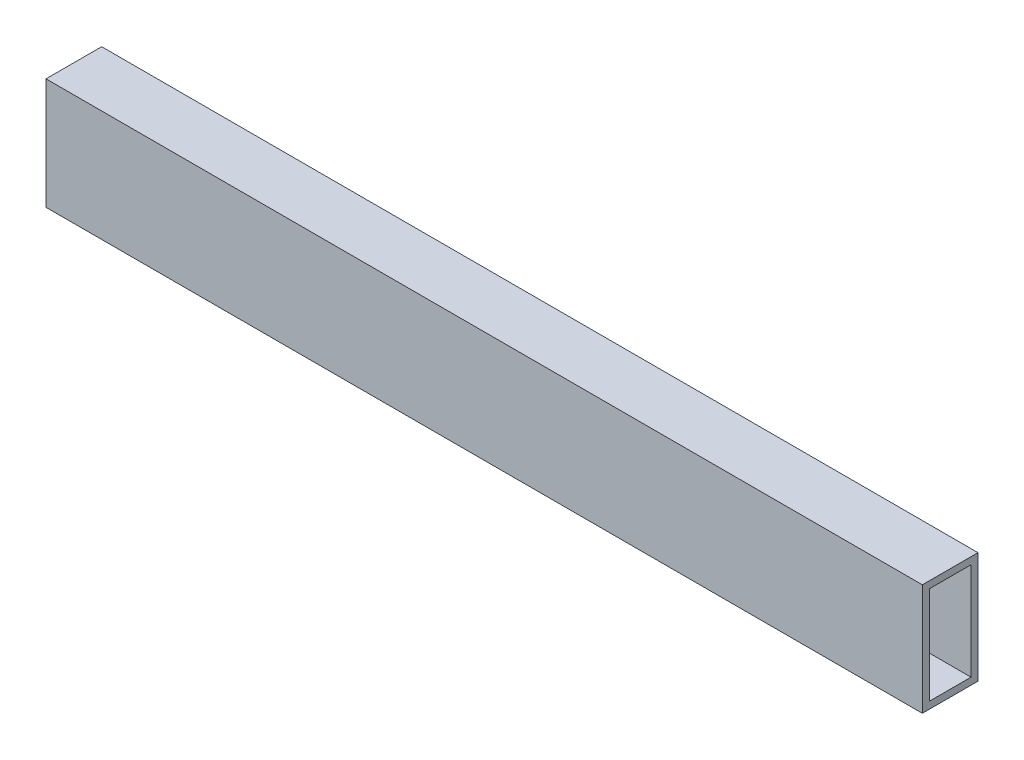
ISO-10303-21;
HEADER;
FILE_DESCRIPTION(('STEP AP214'),'2;1');
FILE_NAME('part.step','',(''),(''),'','','');
FILE_SCHEMA(('AUTOMOTIVE_DESIGN { 1 0 10303 214 1 1 1 1 }'));
ENDSEC;
DATA;
#1=APPLICATION_CONTEXT('core data for automotive mechanical design processes');
#2=APPLICATION_PROTOCOL_DEFINITION('international standard','automotive_design',2000,#1);
#3=PRODUCT_CONTEXT('',#1,'mechanical');
#4=PRODUCT('Part','Part','',(#3));
#5=PRODUCT_RELATED_PRODUCT_CATEGORY('part','',(#4));
#6=PRODUCT_DEFINITION_FORMATION('','',#4);
#7=PRODUCT_DEFINITION_CONTEXT('part definition',#1,'design');
#8=PRODUCT_DEFINITION('design','',#6,#7);
#9=PRODUCT_DEFINITION_SHAPE('','',#8);
#10=(LENGTH_UNIT() NAMED_UNIT(*) SI_UNIT(.MILLI.,.METRE.));
#11=(NAMED_UNIT(*) PLANE_ANGLE_UNIT() SI_UNIT($,.RADIAN.));
#12=(NAMED_UNIT(*) SI_UNIT($,.STERADIAN.) SOLID_ANGLE_UNIT());
#13=UNCERTAINTY_MEASURE_WITH_UNIT(LENGTH_MEASURE(1.E-05),#10,'distance_accuracy_value','');
#14=(GEOMETRIC_REPRESENTATION_CONTEXT(3) GLOBAL_UNCERTAINTY_ASSIGNED_CONTEXT((#13)) GLOBAL_UNIT_ASSIGNED_CONTEXT((#10,
#11,#12)) REPRESENTATION_CONTEXT('',''));
#15=CARTESIAN_POINT('',(0.,0.,0.));
#16=DIRECTION('',(0.,0.,1.));
#17=DIRECTION('',(1.,0.,0.));
#18=AXIS2_PLACEMENT_3D('',#15,#16,#17);
#19=CARTESIAN_POINT('',(400.,0.,0.));
#20=DIRECTION('',(-1.,0.,0.));
#21=DIRECTION('',(0.,0.,1.));
#22=AXIS2_PLACEMENT_3D('',#19,#20,#21);
#23=PLANE('',#22);
#24=DIRECTION('',(0.,-1.,0.));
#25=VECTOR('',#24,1.);
#26=CARTESIAN_POINT('',(400.,0.,0.));
#27=LINE('',#26,#25);
#28=CARTESIAN_POINT('',(400.,50.8,0.));
#29=VERTEX_POINT('',#28);
#30=CARTESIAN_POINT('',(400.,0.,0.));
#31=VERTEX_POINT('',#30);
#32=EDGE_CURVE('E134',#29,#31,#27,.T.);
#33=ORIENTED_EDGE('',*,*,#32,.T.);
#34=DIRECTION('',(0.,0.,-1.));
#35=VECTOR('',#34,1.);
#36=CARTESIAN_POINT('',(400.,0.,0.));
#37=LINE('',#36,#35);
#38=CARTESIAN_POINT('',(400.,0.,-25.4));
#39=VERTEX_POINT('',#38);
#40=EDGE_CURVE('E137',#31,#39,#37,.T.);
#41=ORIENTED_EDGE('',*,*,#40,.T.);
#42=DIRECTION('',(0.,1.,0.));
#43=VECTOR('',#42,1.);
#44=CARTESIAN_POINT('',(400.,0.,-25.4));
#45=LINE('',#44,#43);
#46=CARTESIAN_POINT('',(400.,50.8,-25.4));
#47=VERTEX_POINT('',#46);
#48=EDGE_CURVE('E140',#39,#47,#45,.T.);
#49=ORIENTED_EDGE('',*,*,#48,.T.);
#50=DIRECTION('',(0.,0.,1.));
#51=VECTOR('',#50,1.);
#52=CARTESIAN_POINT('',(400.,50.8,0.));
#53=LINE('',#52,#51);
#54=EDGE_CURVE('E142',#47,#29,#53,.T.);
#55=ORIENTED_EDGE('',*,*,#54,.T.);
#56=EDGE_LOOP('',(#33,#41,#49,#55));
#57=FACE_BOUND('',#56,.T.);
#58=DIRECTION('',(0.,-1.,0.));
#59=VECTOR('',#58,1.);
#60=CARTESIAN_POINT('',(400.,47.625,-3.175));
#61=LINE('',#60,#59);
#62=CARTESIAN_POINT('',(400.,47.625,-3.175));
#63=VERTEX_POINT('',#62);
#64=CARTESIAN_POINT('',(400.,3.175,-3.175));
#65=VERTEX_POINT('',#64);
#66=EDGE_CURVE('E98',#63,#65,#61,.T.);
#67=ORIENTED_EDGE('',*,*,#66,.F.);
#68=DIRECTION('',(0.,0.,1.));
#69=VECTOR('',#68,1.);
#70=CARTESIAN_POINT('',(400.,47.625,-3.175));
#71=LINE('',#70,#69);
#72=CARTESIAN_POINT('',(400.,47.625,-22.225));
#73=VERTEX_POINT('',#72);
#74=EDGE_CURVE('E120',#73,#63,#71,.T.);
#75=ORIENTED_EDGE('',*,*,#74,.F.);
#76=DIRECTION('',(0.,1.,0.));
#77=VECTOR('',#76,1.);
#78=CARTESIAN_POINT('',(400.,47.625,-22.225));
#79=LINE('',#78,#77);
#80=CARTESIAN_POINT('',(400.,3.175,-22.225));
#81=VERTEX_POINT('',#80);
#82=EDGE_CURVE('E118',#81,#73,#79,.T.);
#83=ORIENTED_EDGE('',*,*,#82,.F.);
#84=DIRECTION('',(0.,0.,-1.));
#85=VECTOR('',#84,1.);
#86=CARTESIAN_POINT('',(400.,3.175,-3.175));
#87=LINE('',#86,#85);
#88=EDGE_CURVE('E106',#65,#81,#87,.T.);
#89=ORIENTED_EDGE('',*,*,#88,.F.);
#90=EDGE_LOOP('',(#67,#75,#83,#89));
#91=FACE_BOUND('',#90,.T.);
#92=ADVANCED_FACE('F33',(#57,#91),#23,.F.);
#93=CARTESIAN_POINT('',(0.,0.,0.));
#94=DIRECTION('',(-1.,0.,0.));
#95=DIRECTION('',(0.,0.,1.));
#96=AXIS2_PLACEMENT_3D('',#93,#94,#95);
#97=PLANE('',#96);
#98=DIRECTION('',(0.,-1.,0.));
#99=VECTOR('',#98,1.);
#100=CARTESIAN_POINT('',(0.,0.,0.));
#101=LINE('',#100,#99);
#102=CARTESIAN_POINT('',(0.,50.8,0.));
#103=VERTEX_POINT('',#102);
#104=CARTESIAN_POINT('',(0.,0.,0.));
#105=VERTEX_POINT('',#104);
#106=EDGE_CURVE('E114',#103,#105,#101,.T.);
#107=ORIENTED_EDGE('',*,*,#106,.F.);
#108=DIRECTION('',(0.,0.,1.));
#109=VECTOR('',#108,1.);
#110=CARTESIAN_POINT('',(0.,50.8,0.));
#111=LINE('',#110,#109);
#112=CARTESIAN_POINT('',(0.,50.8,-25.4));
#113=VERTEX_POINT('',#112);
#114=EDGE_CURVE('E138',#113,#103,#111,.T.);
#115=ORIENTED_EDGE('',*,*,#114,.F.);
#116=DIRECTION('',(0.,1.,0.));
#117=VECTOR('',#116,1.);
#118=CARTESIAN_POINT('',(0.,0.,-25.4));
#119=LINE('',#118,#117);
#120=CARTESIAN_POINT('',(0.,0.,-25.4));
#121=VERTEX_POINT('',#120);
#122=EDGE_CURVE('E149',#121,#113,#119,.T.);
#123=ORIENTED_EDGE('',*,*,#122,.F.);
#124=DIRECTION('',(0.,0.,-1.));
#125=VECTOR('',#124,1.);
#126=CARTESIAN_POINT('',(0.,0.,0.));
#127=LINE('',#126,#125);
#128=EDGE_CURVE('E147',#105,#121,#127,.T.);
#129=ORIENTED_EDGE('',*,*,#128,.F.);
#130=EDGE_LOOP('',(#107,#115,#123,#129));
#131=FACE_BOUND('',#130,.T.);
#132=DIRECTION('',(0.,0.,1.));
#133=VECTOR('',#132,1.);
#134=CARTESIAN_POINT('',(0.,47.625,-3.175));
#135=LINE('',#134,#133);
#136=CARTESIAN_POINT('',(0.,47.625,-22.225));
#137=VERTEX_POINT('',#136);
#138=CARTESIAN_POINT('',(0.,47.625,-3.175));
#139=VERTEX_POINT('',#138);
#140=EDGE_CURVE('E107',#137,#139,#135,.T.);
#141=ORIENTED_EDGE('',*,*,#140,.T.);
#142=DIRECTION('',(0.,-1.,0.));
#143=VECTOR('',#142,1.);
#144=CARTESIAN_POINT('',(0.,47.625,-3.175));
#145=LINE('',#144,#143);
#146=CARTESIAN_POINT('',(0.,3.175,-3.175));
#147=VERTEX_POINT('',#146);
#148=EDGE_CURVE('E56',#139,#147,#145,.T.);
#149=ORIENTED_EDGE('',*,*,#148,.T.);
#150=DIRECTION('',(0.,0.,-1.));
#151=VECTOR('',#150,1.);
#152=CARTESIAN_POINT('',(0.,3.175,-3.175));
#153=LINE('',#152,#151);
#154=CARTESIAN_POINT('',(0.,3.175,-22.225));
#155=VERTEX_POINT('',#154);
#156=EDGE_CURVE('E113',#147,#155,#153,.T.);
#157=ORIENTED_EDGE('',*,*,#156,.T.);
#158=DIRECTION('',(0.,1.,0.));
#159=VECTOR('',#158,1.);
#160=CARTESIAN_POINT('',(0.,47.625,-22.225));
#161=LINE('',#160,#159);
#162=EDGE_CURVE('E126',#155,#137,#161,.T.);
#163=ORIENTED_EDGE('',*,*,#162,.T.);
#164=EDGE_LOOP('',(#141,#149,#157,#163));
#165=FACE_BOUND('',#164,.T.);
#166=ADVANCED_FACE('F167',(#131,#165),#97,.T.);
#167=CARTESIAN_POINT('',(400.,0.,0.));
#168=DIRECTION('',(0.,0.,-1.));
#169=DIRECTION('',(-1.,0.,0.));
#170=AXIS2_PLACEMENT_3D('',#167,#168,#169);
#171=PLANE('',#170);
#172=ORIENTED_EDGE('',*,*,#106,.T.);
#173=DIRECTION('',(-1.,0.,0.));
#174=VECTOR('',#173,1.);
#175=CARTESIAN_POINT('',(400.,0.,0.));
#176=LINE('',#175,#174);
#177=EDGE_CURVE('E11',#31,#105,#176,.T.);
#178=ORIENTED_EDGE('',*,*,#177,.F.);
#179=ORIENTED_EDGE('',*,*,#32,.F.);
#180=DIRECTION('',(-1.,0.,0.));
#181=VECTOR('',#180,1.);
#182=CARTESIAN_POINT('',(400.,50.8,0.));
#183=LINE('',#182,#181);
#184=EDGE_CURVE('E144',#29,#103,#183,.T.);
#185=ORIENTED_EDGE('',*,*,#184,.T.);
#186=EDGE_LOOP('',(#172,#178,#179,#185));
#187=FACE_BOUND('',#186,.T.);
#188=ADVANCED_FACE('F35',(#187),#171,.F.);
#189=CARTESIAN_POINT('',(400.,0.,0.));
#190=DIRECTION('',(0.,1.,0.));
#191=DIRECTION('',(0.,0.,1.));
#192=AXIS2_PLACEMENT_3D('',#189,#190,#191);
#193=PLANE('',#192);
#194=ORIENTED_EDGE('',*,*,#128,.T.);
#195=DIRECTION('',(-1.,0.,0.));
#196=VECTOR('',#195,1.);
#197=CARTESIAN_POINT('',(400.,0.,-25.4));
#198=LINE('',#197,#196);
#199=EDGE_CURVE('E41',#39,#121,#198,.T.);
#200=ORIENTED_EDGE('',*,*,#199,.F.);
#201=ORIENTED_EDGE('',*,*,#40,.F.);
#202=ORIENTED_EDGE('',*,*,#177,.T.);
#203=EDGE_LOOP('',(#194,#200,#201,#202));
#204=FACE_BOUND('',#203,.T.);
#205=ADVANCED_FACE('F177',(#204),#193,.F.);
#206=CARTESIAN_POINT('',(400.,0.,-25.4));
#207=DIRECTION('',(0.,0.,1.));
#208=DIRECTION('',(1.,0.,0.));
#209=AXIS2_PLACEMENT_3D('',#206,#207,#208);
#210=PLANE('',#209);
#211=ORIENTED_EDGE('',*,*,#122,.T.);
#212=DIRECTION('',(-1.,0.,0.));
#213=VECTOR('',#212,1.);
#214=CARTESIAN_POINT('',(400.,50.8,-25.4));
#215=LINE('',#214,#213);
#216=EDGE_CURVE('E154',#47,#113,#215,.T.);
#217=ORIENTED_EDGE('',*,*,#216,.F.);
#218=ORIENTED_EDGE('',*,*,#48,.F.);
#219=ORIENTED_EDGE('',*,*,#199,.T.);
#220=EDGE_LOOP('',(#211,#217,#218,#219));
#221=FACE_BOUND('',#220,.T.);
#222=ADVANCED_FACE('F161',(#221),#210,.F.);
#223=CARTESIAN_POINT('',(400.,50.8,0.));
#224=DIRECTION('',(0.,-1.,0.));
#225=DIRECTION('',(0.,0.,-1.));
#226=AXIS2_PLACEMENT_3D('',#223,#224,#225);
#227=PLANE('',#226);
#228=ORIENTED_EDGE('',*,*,#114,.T.);
#229=ORIENTED_EDGE('',*,*,#184,.F.);
#230=ORIENTED_EDGE('',*,*,#54,.F.);
#231=ORIENTED_EDGE('',*,*,#216,.T.);
#232=EDGE_LOOP('',(#228,#229,#230,#231));
#233=FACE_BOUND('',#232,.T.);
#234=ADVANCED_FACE('F171',(#233),#227,.F.);
#235=CARTESIAN_POINT('',(400.,47.625,-3.175));
#236=DIRECTION('',(0.,0.,-1.));
#237=DIRECTION('',(0.,1.,0.));
#238=AXIS2_PLACEMENT_3D('',#235,#236,#237);
#239=PLANE('',#238);
#240=ORIENTED_EDGE('',*,*,#148,.F.);
#241=DIRECTION('',(-1.,0.,0.));
#242=VECTOR('',#241,1.);
#243=CARTESIAN_POINT('',(400.,47.625,-3.175));
#244=LINE('',#243,#242);
#245=EDGE_CURVE('E102',#63,#139,#244,.T.);
#246=ORIENTED_EDGE('',*,*,#245,.F.);
#247=ORIENTED_EDGE('',*,*,#66,.T.);
#248=DIRECTION('',(-1.,0.,0.));
#249=VECTOR('',#248,1.);
#250=CARTESIAN_POINT('',(400.,3.175,-3.175));
#251=LINE('',#250,#249);
#252=EDGE_CURVE('E101',#65,#147,#251,.T.);
#253=ORIENTED_EDGE('',*,*,#252,.T.);
#254=EDGE_LOOP('',(#240,#246,#247,#253));
#255=FACE_BOUND('',#254,.T.);
#256=ADVANCED_FACE('F100',(#255),#239,.T.);
#257=CARTESIAN_POINT('',(400.,3.175,-3.175));
#258=DIRECTION('',(0.,1.,0.));
#259=DIRECTION('',(0.,0.,1.));
#260=AXIS2_PLACEMENT_3D('',#257,#258,#259);
#261=PLANE('',#260);
#262=ORIENTED_EDGE('',*,*,#156,.F.);
#263=ORIENTED_EDGE('',*,*,#252,.F.);
#264=ORIENTED_EDGE('',*,*,#88,.T.);
#265=DIRECTION('',(-1.,0.,0.));
#266=VECTOR('',#265,1.);
#267=CARTESIAN_POINT('',(400.,3.175,-22.225));
#268=LINE('',#267,#266);
#269=EDGE_CURVE('E115',#81,#155,#268,.T.);
#270=ORIENTED_EDGE('',*,*,#269,.T.);
#271=EDGE_LOOP('',(#262,#263,#264,#270));
#272=FACE_BOUND('',#271,.T.);
#273=ADVANCED_FACE('F110',(#272),#261,.T.);
#274=CARTESIAN_POINT('',(400.,47.625,-22.225));
#275=DIRECTION('',(0.,0.,1.));
#276=DIRECTION('',(0.,-1.,0.));
#277=AXIS2_PLACEMENT_3D('',#274,#275,#276);
#278=PLANE('',#277);
#279=ORIENTED_EDGE('',*,*,#162,.F.);
#280=ORIENTED_EDGE('',*,*,#269,.F.);
#281=ORIENTED_EDGE('',*,*,#82,.T.);
#282=DIRECTION('',(-1.,0.,0.));
#283=VECTOR('',#282,1.);
#284=CARTESIAN_POINT('',(400.,47.625,-22.225));
#285=LINE('',#284,#283);
#286=EDGE_CURVE('E48',#73,#137,#285,.T.);
#287=ORIENTED_EDGE('',*,*,#286,.T.);
#288=EDGE_LOOP('',(#279,#280,#281,#287));
#289=FACE_BOUND('',#288,.T.);
#290=ADVANCED_FACE('F200',(#289),#278,.T.);
#291=CARTESIAN_POINT('',(400.,47.625,-3.175));
#292=DIRECTION('',(0.,-1.,0.));
#293=DIRECTION('',(0.,0.,-1.));
#294=AXIS2_PLACEMENT_3D('',#291,#292,#293);
#295=PLANE('',#294);
#296=ORIENTED_EDGE('',*,*,#140,.F.);
#297=ORIENTED_EDGE('',*,*,#286,.F.);
#298=ORIENTED_EDGE('',*,*,#74,.T.);
#299=ORIENTED_EDGE('',*,*,#245,.T.);
#300=EDGE_LOOP('',(#296,#297,#298,#299));
#301=FACE_BOUND('',#300,.T.);
#302=ADVANCED_FACE('F204',(#301),#295,.T.);
#303=CLOSED_SHELL('',(#92,#166,#188,#205,#222,#234,#256,#273,#290,#302));
#304=MANIFOLD_SOLID_BREP('B2',#303);
#305=ADVANCED_BREP_SHAPE_REPRESENTATION('',(#18,#304),#14);
#306=SHAPE_DEFINITION_REPRESENTATION(#9,#305);
ENDSEC;
END-ISO-10303-21;
